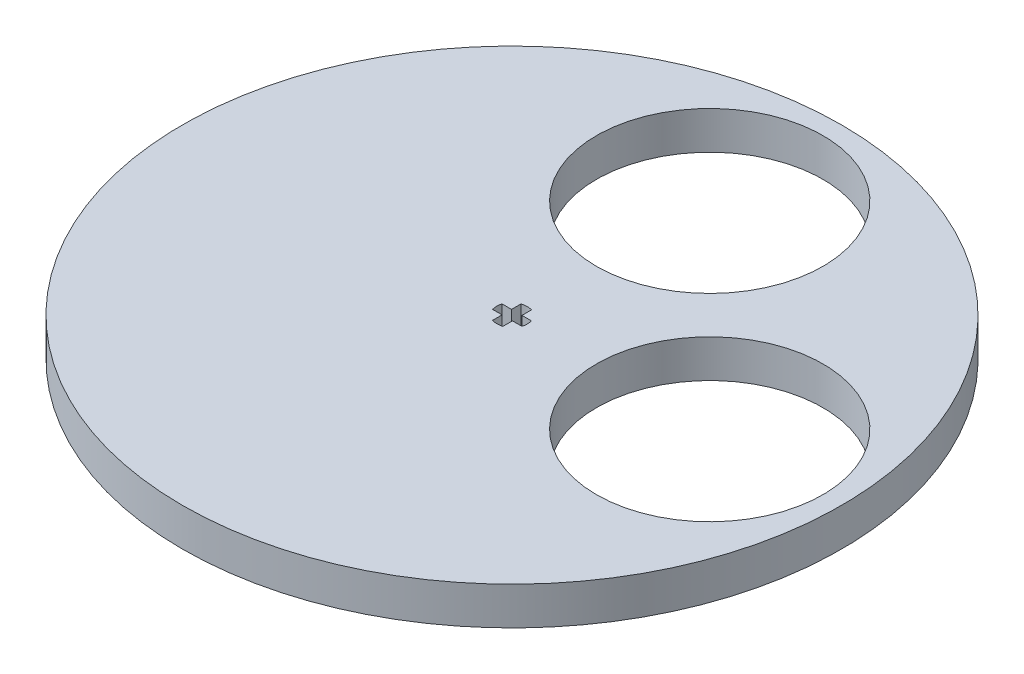
ISO-10303-21;
HEADER;
FILE_DESCRIPTION(('STEP AP214'),'2;1');
FILE_NAME('part.step','',(''),(''),'','','');
FILE_SCHEMA(('AUTOMOTIVE_DESIGN { 1 0 10303 214 1 1 1 1 }'));
ENDSEC;
DATA;
#1=APPLICATION_CONTEXT('core data for automotive mechanical design processes');
#2=APPLICATION_PROTOCOL_DEFINITION('international standard','automotive_design',2000,#1);
#3=PRODUCT_CONTEXT('',#1,'mechanical');
#4=PRODUCT('Part','Part','',(#3));
#5=PRODUCT_RELATED_PRODUCT_CATEGORY('part','',(#4));
#6=PRODUCT_DEFINITION_FORMATION('','',#4);
#7=PRODUCT_DEFINITION_CONTEXT('part definition',#1,'design');
#8=PRODUCT_DEFINITION('design','',#6,#7);
#9=PRODUCT_DEFINITION_SHAPE('','',#8);
#10=(LENGTH_UNIT() NAMED_UNIT(*) SI_UNIT(.MILLI.,.METRE.));
#11=(NAMED_UNIT(*) PLANE_ANGLE_UNIT() SI_UNIT($,.RADIAN.));
#12=(NAMED_UNIT(*) SI_UNIT($,.STERADIAN.) SOLID_ANGLE_UNIT());
#13=UNCERTAINTY_MEASURE_WITH_UNIT(LENGTH_MEASURE(1.E-05),#10,'distance_accuracy_value','');
#14=(GEOMETRIC_REPRESENTATION_CONTEXT(3) GLOBAL_UNCERTAINTY_ASSIGNED_CONTEXT((#13)) GLOBAL_UNIT_ASSIGNED_CONTEXT((#10,
#11,#12)) REPRESENTATION_CONTEXT('',''));
#15=CARTESIAN_POINT('',(0.,0.,0.));
#16=DIRECTION('',(0.,0.,1.));
#17=DIRECTION('',(1.,0.,0.));
#18=AXIS2_PLACEMENT_3D('',#15,#16,#17);
#19=CARTESIAN_POINT('',(63.5,5.84200000000001,-63.5));
#20=DIRECTION('',(0.,-1.,0.));
#21=DIRECTION('',(0.,0.,-1.));
#22=AXIS2_PLACEMENT_3D('',#19,#20,#21);
#23=CYLINDRICAL_SURFACE('',#22,50.8);
#24=CARTESIAN_POINT('',(63.5,5.84200000000001,-63.5));
#25=DIRECTION('',(0.,1.,0.));
#26=DIRECTION('',(0.,0.,1.));
#27=AXIS2_PLACEMENT_3D('',#24,#25,#26);
#28=CIRCLE('',#27,50.8);
#29=CARTESIAN_POINT('',(63.5,5.84200000000001,-12.7));
#30=VERTEX_POINT('',#29);
#31=EDGE_CURVE('E12',#30,#30,#28,.T.);
#32=ORIENTED_EDGE('',*,*,#31,.F.);
#33=EDGE_LOOP('',(#32));
#34=FACE_BOUND('',#33,.T.);
#35=CARTESIAN_POINT('',(63.5,0.,-63.5));
#36=DIRECTION('',(0.,1.,0.));
#37=DIRECTION('',(0.,0.,1.));
#38=AXIS2_PLACEMENT_3D('',#35,#36,#37);
#39=CIRCLE('',#38,50.8);
#40=CARTESIAN_POINT('',(63.5,0.,-12.7));
#41=VERTEX_POINT('',#40);
#42=EDGE_CURVE('E61',#41,#41,#39,.T.);
#43=ORIENTED_EDGE('',*,*,#42,.T.);
#44=EDGE_LOOP('',(#43));
#45=FACE_BOUND('',#44,.T.);
#46=ADVANCED_FACE('F58',(#34,#45),#23,.T.);
#47=CARTESIAN_POINT('',(63.5,5.84200000000001,-63.5));
#48=DIRECTION('',(0.,1.,0.));
#49=DIRECTION('',(0.,0.,1.));
#50=AXIS2_PLACEMENT_3D('',#47,#48,#49);
#51=PLANE('',#50);
#52=CARTESIAN_POINT('',(93.98,5.84200000000001,-63.5));
#53=DIRECTION('',(0.,1.,0.));
#54=DIRECTION('',(0.,0.,1.));
#55=AXIS2_PLACEMENT_3D('',#52,#53,#54);
#56=CIRCLE('',#55,17.4625);
#57=CARTESIAN_POINT('',(93.98,5.84200000000001,-46.0375));
#58=VERTEX_POINT('',#57);
#59=EDGE_CURVE('E243',#58,#58,#56,.T.);
#60=ORIENTED_EDGE('',*,*,#59,.F.);
#61=EDGE_LOOP('',(#60));
#62=FACE_BOUND('',#61,.T.);
#63=CARTESIAN_POINT('',(63.5,5.84200000000001,-93.98));
#64=DIRECTION('',(0.,1.,0.));
#65=DIRECTION('',(0.,0.,1.));
#66=AXIS2_PLACEMENT_3D('',#63,#64,#65);
#67=CIRCLE('',#66,17.4625);
#68=CARTESIAN_POINT('',(63.5,5.84200000000001,-76.5175));
#69=VERTEX_POINT('',#68);
#70=EDGE_CURVE('E247',#69,#69,#67,.T.);
#71=ORIENTED_EDGE('',*,*,#70,.F.);
#72=EDGE_LOOP('',(#71));
#73=FACE_BOUND('',#72,.T.);
#74=ORIENTED_EDGE('',*,*,#31,.T.);
#75=EDGE_LOOP('',(#74));
#76=FACE_BOUND('',#75,.T.);
#77=DIRECTION('',(-1.,0.,0.));
#78=VECTOR('',#77,1.);
#79=CARTESIAN_POINT('',(62.7,5.84200000000001,-64.23137085));
#80=LINE('',#79,#78);
#81=CARTESIAN_POINT('',(62.7,5.84200000000001,-64.23137085));
#82=VERTEX_POINT('',#81);
#83=CARTESIAN_POINT('',(61.2372583,5.84200000000001,-64.23137085));
#84=VERTEX_POINT('',#83);
#85=EDGE_CURVE('E164',#82,#84,#80,.T.);
#86=ORIENTED_EDGE('',*,*,#85,.F.);
#87=DIRECTION('',(0.,0.,1.));
#88=VECTOR('',#87,1.);
#89=CARTESIAN_POINT('',(62.7,5.84200000000001,-64.23137085));
#90=LINE('',#89,#88);
#91=CARTESIAN_POINT('',(62.7,5.84200000000001,-65.69411255));
#92=VERTEX_POINT('',#91);
#93=EDGE_CURVE('E205',#92,#82,#90,.T.);
#94=ORIENTED_EDGE('',*,*,#93,.F.);
#95=CARTESIAN_POINT('',(63.5,5.84200000000001,-63.2202491746295));
#96=DIRECTION('',(0.,1.,0.));
#97=DIRECTION('',(0.,0.,-1.));
#98=AXIS2_PLACEMENT_3D('',#95,#96,#97);
#99=CIRCLE('',#98,2.6);
#100=CARTESIAN_POINT('',(64.3,5.84200000000001,-65.6941125500001));
#101=VERTEX_POINT('',#100);
#102=EDGE_CURVE('E201',#101,#92,#99,.T.);
#103=ORIENTED_EDGE('',*,*,#102,.F.);
#104=DIRECTION('',(0.,0.,-1.));
#105=VECTOR('',#104,1.);
#106=CARTESIAN_POINT('',(64.3,5.84200000000001,-65.6941125500001));
#107=LINE('',#106,#105);
#108=CARTESIAN_POINT('',(64.3,5.84200000000001,-64.23137085));
#109=VERTEX_POINT('',#108);
#110=EDGE_CURVE('E197',#109,#101,#107,.T.);
#111=ORIENTED_EDGE('',*,*,#110,.F.);
#112=DIRECTION('',(-1.,0.,0.));
#113=VECTOR('',#112,1.);
#114=CARTESIAN_POINT('',(64.3,5.84200000000001,-64.23137085));
#115=LINE('',#114,#113);
#116=CARTESIAN_POINT('',(65.7627417,5.84200000000001,-64.23137085));
#117=VERTEX_POINT('',#116);
#118=EDGE_CURVE('E193',#117,#109,#115,.T.);
#119=ORIENTED_EDGE('',*,*,#118,.F.);
#120=CARTESIAN_POINT('',(63.267727335358,5.84200000000001,-63.5));
#121=DIRECTION('',(0.,1.,0.));
#122=DIRECTION('',(0.,0.,-1.));
#123=AXIS2_PLACEMENT_3D('',#120,#121,#122);
#124=CIRCLE('',#123,2.6);
#125=CARTESIAN_POINT('',(65.7627417,5.84200000000001,-62.76862915));
#126=VERTEX_POINT('',#125);
#127=EDGE_CURVE('E189',#126,#117,#124,.T.);
#128=ORIENTED_EDGE('',*,*,#127,.F.);
#129=DIRECTION('',(1.,0.,0.));
#130=VECTOR('',#129,1.);
#131=CARTESIAN_POINT('',(64.3,5.84200000000001,-62.76862915));
#132=LINE('',#131,#130);
#133=CARTESIAN_POINT('',(64.3,5.84200000000001,-62.76862915));
#134=VERTEX_POINT('',#133);
#135=EDGE_CURVE('E185',#134,#126,#132,.T.);
#136=ORIENTED_EDGE('',*,*,#135,.F.);
#137=DIRECTION('',(0.,0.,-1.));
#138=VECTOR('',#137,1.);
#139=CARTESIAN_POINT('',(64.3,5.84200000000001,-61.30588745));
#140=LINE('',#139,#138);
#141=CARTESIAN_POINT('',(64.3,5.84200000000001,-61.30588745));
#142=VERTEX_POINT('',#141);
#143=EDGE_CURVE('E181',#142,#134,#140,.T.);
#144=ORIENTED_EDGE('',*,*,#143,.F.);
#145=CARTESIAN_POINT('',(63.5,5.84200000000001,-63.7797508253706));
#146=DIRECTION('',(0.,1.,0.));
#147=DIRECTION('',(0.,0.,1.));
#148=AXIS2_PLACEMENT_3D('',#145,#146,#147);
#149=CIRCLE('',#148,2.6);
#150=CARTESIAN_POINT('',(62.7,5.84200000000001,-61.30588745));
#151=VERTEX_POINT('',#150);
#152=EDGE_CURVE('E174',#151,#142,#149,.T.);
#153=ORIENTED_EDGE('',*,*,#152,.F.);
#154=DIRECTION('',(0.,0.,1.));
#155=VECTOR('',#154,1.);
#156=CARTESIAN_POINT('',(62.7,5.84200000000001,-62.76862915));
#157=LINE('',#156,#155);
#158=CARTESIAN_POINT('',(62.7,5.84200000000001,-62.76862915));
#159=VERTEX_POINT('',#158);
#160=EDGE_CURVE('E169',#159,#151,#157,.T.);
#161=ORIENTED_EDGE('',*,*,#160,.F.);
#162=DIRECTION('',(1.,0.,0.));
#163=VECTOR('',#162,1.);
#164=CARTESIAN_POINT('',(61.2372583,5.84200000000001,-62.76862915));
#165=LINE('',#164,#163);
#166=CARTESIAN_POINT('',(61.2372583,5.84200000000001,-62.76862915));
#167=VERTEX_POINT('',#166);
#168=EDGE_CURVE('E149',#167,#159,#165,.T.);
#169=ORIENTED_EDGE('',*,*,#168,.F.);
#170=CARTESIAN_POINT('',(63.7322726646421,5.84200000000001,-63.5));
#171=DIRECTION('',(0.,1.,0.));
#172=DIRECTION('',(0.,0.,1.));
#173=AXIS2_PLACEMENT_3D('',#170,#171,#172);
#174=CIRCLE('',#173,2.6);
#175=EDGE_CURVE('E157',#84,#167,#174,.T.);
#176=ORIENTED_EDGE('',*,*,#175,.F.);
#177=EDGE_LOOP('',(#86,#94,#103,#111,#119,#128,#136,#144,#153,#161,#169,#176));
#178=FACE_BOUND('',#177,.T.);
#179=ADVANCED_FACE('F166',(#62,#73,#76,#178),#51,.T.);
#180=CARTESIAN_POINT('',(63.5,0.,-63.5));
#181=DIRECTION('',(0.,1.,0.));
#182=DIRECTION('',(0.,0.,1.));
#183=AXIS2_PLACEMENT_3D('',#180,#181,#182);
#184=PLANE('',#183);
#185=CARTESIAN_POINT('',(93.98,0.,-63.5));
#186=DIRECTION('',(0.,1.,0.));
#187=DIRECTION('',(0.,0.,1.));
#188=AXIS2_PLACEMENT_3D('',#185,#186,#187);
#189=CIRCLE('',#188,17.4625);
#190=CARTESIAN_POINT('',(93.98,0.,-46.0375));
#191=VERTEX_POINT('',#190);
#192=EDGE_CURVE('E248',#191,#191,#189,.T.);
#193=ORIENTED_EDGE('',*,*,#192,.T.);
#194=EDGE_LOOP('',(#193));
#195=FACE_BOUND('',#194,.T.);
#196=CARTESIAN_POINT('',(63.5,0.,-93.98));
#197=DIRECTION('',(0.,1.,0.));
#198=DIRECTION('',(0.,0.,1.));
#199=AXIS2_PLACEMENT_3D('',#196,#197,#198);
#200=CIRCLE('',#199,17.4625);
#201=CARTESIAN_POINT('',(63.5,0.,-76.5175));
#202=VERTEX_POINT('',#201);
#203=EDGE_CURVE('E252',#202,#202,#200,.T.);
#204=ORIENTED_EDGE('',*,*,#203,.T.);
#205=EDGE_LOOP('',(#204));
#206=FACE_BOUND('',#205,.T.);
#207=ORIENTED_EDGE('',*,*,#42,.F.);
#208=EDGE_LOOP('',(#207));
#209=FACE_BOUND('',#208,.T.);
#210=CARTESIAN_POINT('',(63.7322726646421,0.,-63.5));
#211=DIRECTION('',(0.,1.,0.));
#212=DIRECTION('',(0.,0.,1.));
#213=AXIS2_PLACEMENT_3D('',#210,#211,#212);
#214=CIRCLE('',#213,2.6);
#215=CARTESIAN_POINT('',(61.2372583,0.,-62.76862915));
#216=VERTEX_POINT('',#215);
#217=CARTESIAN_POINT('',(61.2372583,0.,-64.23137085));
#218=VERTEX_POINT('',#217);
#219=EDGE_CURVE('E73',#216,#218,#214,.F.);
#220=ORIENTED_EDGE('',*,*,#219,.F.);
#221=DIRECTION('',(-1.,0.,0.));
#222=VECTOR('',#221,1.);
#223=CARTESIAN_POINT('',(61.2372583,0.,-62.76862915));
#224=LINE('',#223,#222);
#225=CARTESIAN_POINT('',(62.7,0.,-62.76862915));
#226=VERTEX_POINT('',#225);
#227=EDGE_CURVE('E77',#226,#216,#224,.T.);
#228=ORIENTED_EDGE('',*,*,#227,.F.);
#229=DIRECTION('',(0.,0.,-1.));
#230=VECTOR('',#229,1.);
#231=CARTESIAN_POINT('',(62.7,0.,-62.76862915));
#232=LINE('',#231,#230);
#233=CARTESIAN_POINT('',(62.7,0.,-61.30588745));
#234=VERTEX_POINT('',#233);
#235=EDGE_CURVE('E377',#234,#226,#232,.T.);
#236=ORIENTED_EDGE('',*,*,#235,.F.);
#237=CARTESIAN_POINT('',(63.5,0.,-63.7797508253706));
#238=DIRECTION('',(0.,1.,0.));
#239=DIRECTION('',(0.,0.,1.));
#240=AXIS2_PLACEMENT_3D('',#237,#238,#239);
#241=CIRCLE('',#240,2.6);
#242=CARTESIAN_POINT('',(64.3,0.,-61.30588745));
#243=VERTEX_POINT('',#242);
#244=EDGE_CURVE('E375',#243,#234,#241,.F.);
#245=ORIENTED_EDGE('',*,*,#244,.F.);
#246=DIRECTION('',(0.,0.,1.));
#247=VECTOR('',#246,1.);
#248=CARTESIAN_POINT('',(64.3,0.,-61.30588745));
#249=LINE('',#248,#247);
#250=CARTESIAN_POINT('',(64.3,0.,-62.76862915));
#251=VERTEX_POINT('',#250);
#252=EDGE_CURVE('E384',#251,#243,#249,.T.);
#253=ORIENTED_EDGE('',*,*,#252,.F.);
#254=DIRECTION('',(-1.,0.,0.));
#255=VECTOR('',#254,1.);
#256=CARTESIAN_POINT('',(64.3,0.,-62.76862915));
#257=LINE('',#256,#255);
#258=CARTESIAN_POINT('',(65.7627417,0.,-62.76862915));
#259=VERTEX_POINT('',#258);
#260=EDGE_CURVE('E370',#259,#251,#257,.T.);
#261=ORIENTED_EDGE('',*,*,#260,.F.);
#262=CARTESIAN_POINT('',(63.267727335358,0.,-63.5));
#263=DIRECTION('',(0.,1.,0.));
#264=DIRECTION('',(0.,0.,1.));
#265=AXIS2_PLACEMENT_3D('',#262,#263,#264);
#266=CIRCLE('',#265,2.6);
#267=CARTESIAN_POINT('',(65.7627417,0.,-64.23137085));
#268=VERTEX_POINT('',#267);
#269=EDGE_CURVE('E367',#268,#259,#266,.F.);
#270=ORIENTED_EDGE('',*,*,#269,.F.);
#271=DIRECTION('',(1.,0.,0.));
#272=VECTOR('',#271,1.);
#273=CARTESIAN_POINT('',(64.3,0.,-64.23137085));
#274=LINE('',#273,#272);
#275=CARTESIAN_POINT('',(64.3,0.,-64.23137085));
#276=VERTEX_POINT('',#275);
#277=EDGE_CURVE('E393',#276,#268,#274,.T.);
#278=ORIENTED_EDGE('',*,*,#277,.F.);
#279=DIRECTION('',(0.,0.,1.));
#280=VECTOR('',#279,1.);
#281=CARTESIAN_POINT('',(64.3,0.,-65.6941125500001));
#282=LINE('',#281,#280);
#283=CARTESIAN_POINT('',(64.3,0.,-65.6941125500001));
#284=VERTEX_POINT('',#283);
#285=EDGE_CURVE('E359',#284,#276,#282,.T.);
#286=ORIENTED_EDGE('',*,*,#285,.F.);
#287=CARTESIAN_POINT('',(63.5,0.,-63.2202491746295));
#288=DIRECTION('',(0.,1.,0.));
#289=DIRECTION('',(0.,0.,1.));
#290=AXIS2_PLACEMENT_3D('',#287,#288,#289);
#291=CIRCLE('',#290,2.6);
#292=CARTESIAN_POINT('',(62.7,0.,-65.69411255));
#293=VERTEX_POINT('',#292);
#294=EDGE_CURVE('E346',#293,#284,#291,.F.);
#295=ORIENTED_EDGE('',*,*,#294,.F.);
#296=DIRECTION('',(0.,0.,-1.));
#297=VECTOR('',#296,1.);
#298=CARTESIAN_POINT('',(62.7,0.,-64.23137085));
#299=LINE('',#298,#297);
#300=CARTESIAN_POINT('',(62.7,0.,-64.23137085));
#301=VERTEX_POINT('',#300);
#302=EDGE_CURVE('E340',#301,#293,#299,.T.);
#303=ORIENTED_EDGE('',*,*,#302,.F.);
#304=DIRECTION('',(1.,0.,0.));
#305=VECTOR('',#304,1.);
#306=CARTESIAN_POINT('',(62.7,0.,-64.23137085));
#307=LINE('',#306,#305);
#308=EDGE_CURVE('E242',#218,#301,#307,.T.);
#309=ORIENTED_EDGE('',*,*,#308,.F.);
#310=EDGE_LOOP('',(#220,#228,#236,#245,#253,#261,#270,#278,#286,#295,#303,#309));
#311=FACE_BOUND('',#310,.T.);
#312=ADVANCED_FACE('F265',(#195,#206,#209,#311),#184,.F.);
#313=CARTESIAN_POINT('',(63.5,0.,-93.98));
#314=DIRECTION('',(0.,1.,0.));
#315=DIRECTION('',(0.,0.,1.));
#316=AXIS2_PLACEMENT_3D('',#313,#314,#315);
#317=CYLINDRICAL_SURFACE('',#316,17.4625);
#318=ORIENTED_EDGE('',*,*,#203,.F.);
#319=EDGE_LOOP('',(#318));
#320=FACE_BOUND('',#319,.T.);
#321=ORIENTED_EDGE('',*,*,#70,.T.);
#322=EDGE_LOOP('',(#321));
#323=FACE_BOUND('',#322,.T.);
#324=ADVANCED_FACE('F261',(#320,#323),#317,.F.);
#325=CARTESIAN_POINT('',(93.98,0.,-63.5));
#326=DIRECTION('',(0.,1.,0.));
#327=DIRECTION('',(0.,0.,1.));
#328=AXIS2_PLACEMENT_3D('',#325,#326,#327);
#329=CYLINDRICAL_SURFACE('',#328,17.4625);
#330=ORIENTED_EDGE('',*,*,#192,.F.);
#331=EDGE_LOOP('',(#330));
#332=FACE_BOUND('',#331,.T.);
#333=ORIENTED_EDGE('',*,*,#59,.T.);
#334=EDGE_LOOP('',(#333));
#335=FACE_BOUND('',#334,.T.);
#336=ADVANCED_FACE('F284',(#332,#335),#329,.F.);
#337=CARTESIAN_POINT('',(63.7322726646421,-7.77817459305205,-63.5));
#338=DIRECTION('',(0.,1.,0.));
#339=DIRECTION('',(0.,0.,1.));
#340=AXIS2_PLACEMENT_3D('',#337,#338,#339);
#341=CYLINDRICAL_SURFACE('',#340,2.6);
#342=DIRECTION('',(0.,1.,0.));
#343=VECTOR('',#342,1.);
#344=CARTESIAN_POINT('',(61.2372583,-7.77817459305205,-62.76862915));
#345=LINE('',#344,#343);
#346=EDGE_CURVE('E145',#216,#167,#345,.T.);
#347=ORIENTED_EDGE('',*,*,#346,.F.);
#348=ORIENTED_EDGE('',*,*,#219,.T.);
#349=DIRECTION('',(0.,1.,0.));
#350=VECTOR('',#349,1.);
#351=CARTESIAN_POINT('',(61.2372583,-7.77817459305205,-64.23137085));
#352=LINE('',#351,#350);
#353=EDGE_CURVE('E154',#218,#84,#352,.T.);
#354=ORIENTED_EDGE('',*,*,#353,.T.);
#355=ORIENTED_EDGE('',*,*,#175,.T.);
#356=EDGE_LOOP('',(#347,#348,#354,#355));
#357=FACE_BOUND('',#356,.T.);
#358=ADVANCED_FACE('F158',(#357),#341,.F.);
#359=CARTESIAN_POINT('',(61.2372583,-7.77817459305205,-62.76862915));
#360=DIRECTION('',(0.,0.,1.));
#361=DIRECTION('',(1.,0.,0.));
#362=AXIS2_PLACEMENT_3D('',#359,#360,#361);
#363=PLANE('',#362);
#364=DIRECTION('',(0.,1.,0.));
#365=VECTOR('',#364,1.);
#366=CARTESIAN_POINT('',(62.7,-7.77817459305205,-62.76862915));
#367=LINE('',#366,#365);
#368=EDGE_CURVE('E153',#226,#159,#367,.T.);
#369=ORIENTED_EDGE('',*,*,#368,.F.);
#370=ORIENTED_EDGE('',*,*,#227,.T.);
#371=ORIENTED_EDGE('',*,*,#346,.T.);
#372=ORIENTED_EDGE('',*,*,#168,.T.);
#373=EDGE_LOOP('',(#369,#370,#371,#372));
#374=FACE_BOUND('',#373,.T.);
#375=ADVANCED_FACE('F147',(#374),#363,.F.);
#376=CARTESIAN_POINT('',(62.7,-7.77817459305205,-62.76862915));
#377=DIRECTION('',(-1.,0.,0.));
#378=DIRECTION('',(0.,0.,1.));
#379=AXIS2_PLACEMENT_3D('',#376,#377,#378);
#380=PLANE('',#379);
#381=DIRECTION('',(0.,1.,0.));
#382=VECTOR('',#381,1.);
#383=CARTESIAN_POINT('',(62.7,-7.77817459305205,-61.30588745));
#384=LINE('',#383,#382);
#385=EDGE_CURVE('E233',#234,#151,#384,.T.);
#386=ORIENTED_EDGE('',*,*,#385,.F.);
#387=ORIENTED_EDGE('',*,*,#235,.T.);
#388=ORIENTED_EDGE('',*,*,#368,.T.);
#389=ORIENTED_EDGE('',*,*,#160,.T.);
#390=EDGE_LOOP('',(#386,#387,#388,#389));
#391=FACE_BOUND('',#390,.T.);
#392=ADVANCED_FACE('F301',(#391),#380,.F.);
#393=CARTESIAN_POINT('',(63.5,-7.77817459305205,-63.7797508253706));
#394=DIRECTION('',(0.,1.,0.));
#395=DIRECTION('',(0.,0.,1.));
#396=AXIS2_PLACEMENT_3D('',#393,#394,#395);
#397=CYLINDRICAL_SURFACE('',#396,2.6);
#398=DIRECTION('',(0.,1.,0.));
#399=VECTOR('',#398,1.);
#400=CARTESIAN_POINT('',(64.3,-7.77817459305205,-61.30588745));
#401=LINE('',#400,#399);
#402=EDGE_CURVE('E230',#243,#142,#401,.T.);
#403=ORIENTED_EDGE('',*,*,#402,.F.);
#404=ORIENTED_EDGE('',*,*,#244,.T.);
#405=ORIENTED_EDGE('',*,*,#385,.T.);
#406=ORIENTED_EDGE('',*,*,#152,.T.);
#407=EDGE_LOOP('',(#403,#404,#405,#406));
#408=FACE_BOUND('',#407,.T.);
#409=ADVANCED_FACE('F304',(#408),#397,.F.);
#410=CARTESIAN_POINT('',(64.3,-7.77817459305205,-61.30588745));
#411=DIRECTION('',(1.,0.,0.));
#412=DIRECTION('',(0.,0.,-1.));
#413=AXIS2_PLACEMENT_3D('',#410,#411,#412);
#414=PLANE('',#413);
#415=DIRECTION('',(0.,1.,0.));
#416=VECTOR('',#415,1.);
#417=CARTESIAN_POINT('',(64.3,-7.77817459305205,-62.76862915));
#418=LINE('',#417,#416);
#419=EDGE_CURVE('E227',#251,#134,#418,.T.);
#420=ORIENTED_EDGE('',*,*,#419,.F.);
#421=ORIENTED_EDGE('',*,*,#252,.T.);
#422=ORIENTED_EDGE('',*,*,#402,.T.);
#423=ORIENTED_EDGE('',*,*,#143,.T.);
#424=EDGE_LOOP('',(#420,#421,#422,#423));
#425=FACE_BOUND('',#424,.T.);
#426=ADVANCED_FACE('F308',(#425),#414,.F.);
#427=CARTESIAN_POINT('',(64.3,-7.77817459305205,-62.76862915));
#428=DIRECTION('',(0.,0.,1.));
#429=DIRECTION('',(1.,0.,0.));
#430=AXIS2_PLACEMENT_3D('',#427,#428,#429);
#431=PLANE('',#430);
#432=DIRECTION('',(0.,1.,0.));
#433=VECTOR('',#432,1.);
#434=CARTESIAN_POINT('',(65.7627417,-7.77817459305205,-62.76862915));
#435=LINE('',#434,#433);
#436=EDGE_CURVE('E224',#259,#126,#435,.T.);
#437=ORIENTED_EDGE('',*,*,#436,.F.);
#438=ORIENTED_EDGE('',*,*,#260,.T.);
#439=ORIENTED_EDGE('',*,*,#419,.T.);
#440=ORIENTED_EDGE('',*,*,#135,.T.);
#441=EDGE_LOOP('',(#437,#438,#439,#440));
#442=FACE_BOUND('',#441,.T.);
#443=ADVANCED_FACE('F312',(#442),#431,.F.);
#444=CARTESIAN_POINT('',(63.267727335358,-7.77817459305205,-63.5));
#445=DIRECTION('',(0.,1.,0.));
#446=DIRECTION('',(0.,0.,1.));
#447=AXIS2_PLACEMENT_3D('',#444,#445,#446);
#448=CYLINDRICAL_SURFACE('',#447,2.6);
#449=DIRECTION('',(0.,1.,0.));
#450=VECTOR('',#449,1.);
#451=CARTESIAN_POINT('',(65.7627417,-7.77817459305205,-64.23137085));
#452=LINE('',#451,#450);
#453=EDGE_CURVE('E221',#268,#117,#452,.T.);
#454=ORIENTED_EDGE('',*,*,#453,.F.);
#455=ORIENTED_EDGE('',*,*,#269,.T.);
#456=ORIENTED_EDGE('',*,*,#436,.T.);
#457=ORIENTED_EDGE('',*,*,#127,.T.);
#458=EDGE_LOOP('',(#454,#455,#456,#457));
#459=FACE_BOUND('',#458,.T.);
#460=ADVANCED_FACE('F316',(#459),#448,.F.);
#461=CARTESIAN_POINT('',(64.3,-7.77817459305205,-64.23137085));
#462=DIRECTION('',(0.,0.,-1.));
#463=DIRECTION('',(-1.,0.,0.));
#464=AXIS2_PLACEMENT_3D('',#461,#462,#463);
#465=PLANE('',#464);
#466=DIRECTION('',(0.,1.,0.));
#467=VECTOR('',#466,1.);
#468=CARTESIAN_POINT('',(64.3,-7.77817459305205,-64.23137085));
#469=LINE('',#468,#467);
#470=EDGE_CURVE('E218',#276,#109,#469,.T.);
#471=ORIENTED_EDGE('',*,*,#470,.F.);
#472=ORIENTED_EDGE('',*,*,#277,.T.);
#473=ORIENTED_EDGE('',*,*,#453,.T.);
#474=ORIENTED_EDGE('',*,*,#118,.T.);
#475=EDGE_LOOP('',(#471,#472,#473,#474));
#476=FACE_BOUND('',#475,.T.);
#477=ADVANCED_FACE('F320',(#476),#465,.F.);
#478=CARTESIAN_POINT('',(64.3,-7.77817459305205,-65.6941125500001));
#479=DIRECTION('',(1.,0.,0.));
#480=DIRECTION('',(0.,0.,-1.));
#481=AXIS2_PLACEMENT_3D('',#478,#479,#480);
#482=PLANE('',#481);
#483=DIRECTION('',(0.,1.,0.));
#484=VECTOR('',#483,1.);
#485=CARTESIAN_POINT('',(64.3,-7.77817459305205,-65.6941125500001));
#486=LINE('',#485,#484);
#487=EDGE_CURVE('E215',#284,#101,#486,.T.);
#488=ORIENTED_EDGE('',*,*,#487,.F.);
#489=ORIENTED_EDGE('',*,*,#285,.T.);
#490=ORIENTED_EDGE('',*,*,#470,.T.);
#491=ORIENTED_EDGE('',*,*,#110,.T.);
#492=EDGE_LOOP('',(#488,#489,#490,#491));
#493=FACE_BOUND('',#492,.T.);
#494=ADVANCED_FACE('F324',(#493),#482,.F.);
#495=CARTESIAN_POINT('',(63.5,-7.77817459305205,-63.2202491746295));
#496=DIRECTION('',(0.,1.,0.));
#497=DIRECTION('',(0.,0.,1.));
#498=AXIS2_PLACEMENT_3D('',#495,#496,#497);
#499=CYLINDRICAL_SURFACE('',#498,2.6);
#500=DIRECTION('',(0.,1.,0.));
#501=VECTOR('',#500,1.);
#502=CARTESIAN_POINT('',(62.7,-7.77817459305205,-65.69411255));
#503=LINE('',#502,#501);
#504=EDGE_CURVE('E212',#293,#92,#503,.T.);
#505=ORIENTED_EDGE('',*,*,#504,.F.);
#506=ORIENTED_EDGE('',*,*,#294,.T.);
#507=ORIENTED_EDGE('',*,*,#487,.T.);
#508=ORIENTED_EDGE('',*,*,#102,.T.);
#509=EDGE_LOOP('',(#505,#506,#507,#508));
#510=FACE_BOUND('',#509,.T.);
#511=ADVANCED_FACE('F328',(#510),#499,.F.);
#512=CARTESIAN_POINT('',(62.7,-7.77817459305205,-64.23137085));
#513=DIRECTION('',(-1.,0.,0.));
#514=DIRECTION('',(0.,0.,1.));
#515=AXIS2_PLACEMENT_3D('',#512,#513,#514);
#516=PLANE('',#515);
#517=DIRECTION('',(0.,1.,0.));
#518=VECTOR('',#517,1.);
#519=CARTESIAN_POINT('',(62.7,-7.77817459305205,-64.23137085));
#520=LINE('',#519,#518);
#521=EDGE_CURVE('E209',#301,#82,#520,.T.);
#522=ORIENTED_EDGE('',*,*,#521,.F.);
#523=ORIENTED_EDGE('',*,*,#302,.T.);
#524=ORIENTED_EDGE('',*,*,#504,.T.);
#525=ORIENTED_EDGE('',*,*,#93,.T.);
#526=EDGE_LOOP('',(#522,#523,#524,#525));
#527=FACE_BOUND('',#526,.T.);
#528=ADVANCED_FACE('F295',(#527),#516,.F.);
#529=CARTESIAN_POINT('',(62.7,-7.77817459305205,-64.23137085));
#530=DIRECTION('',(0.,0.,-1.));
#531=DIRECTION('',(-1.,0.,0.));
#532=AXIS2_PLACEMENT_3D('',#529,#530,#531);
#533=PLANE('',#532);
#534=ORIENTED_EDGE('',*,*,#353,.F.);
#535=ORIENTED_EDGE('',*,*,#308,.T.);
#536=ORIENTED_EDGE('',*,*,#521,.T.);
#537=ORIENTED_EDGE('',*,*,#85,.T.);
#538=EDGE_LOOP('',(#534,#535,#536,#537));
#539=FACE_BOUND('',#538,.T.);
#540=ADVANCED_FACE('F292',(#539),#533,.F.);
#541=CLOSED_SHELL('',(#46,#179,#312,#324,#336,#358,#375,#392,#409,#426,#443,#460,#477,#494,#511,
#528,#540));
#542=MANIFOLD_SOLID_BREP('B2',#541);
#543=ADVANCED_BREP_SHAPE_REPRESENTATION('',(#18,#542),#14);
#544=SHAPE_DEFINITION_REPRESENTATION(#9,#543);
ENDSEC;
END-ISO-10303-21;
